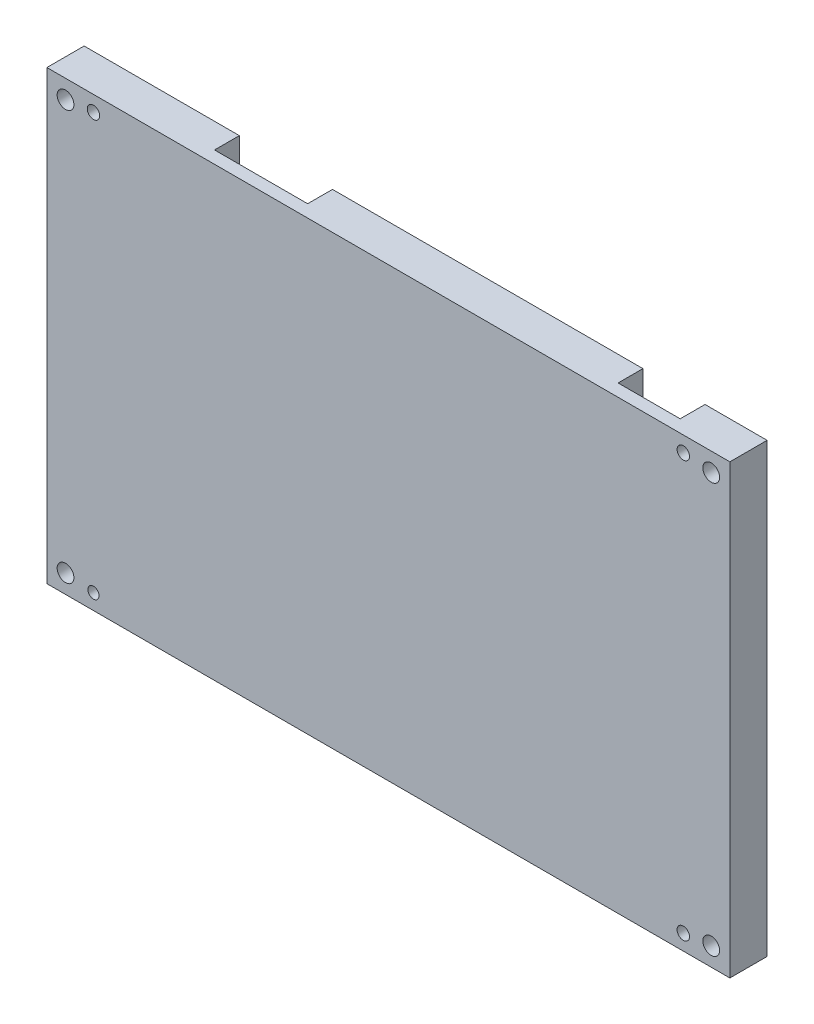
ISO-10303-21;
HEADER;
FILE_DESCRIPTION(('STEP AP214'),'2;1');
FILE_NAME('part.step','',(''),(''),'','','');
FILE_SCHEMA(('AUTOMOTIVE_DESIGN { 1 0 10303 214 1 1 1 1 }'));
ENDSEC;
DATA;
#1=APPLICATION_CONTEXT('core data for automotive mechanical design processes');
#2=APPLICATION_PROTOCOL_DEFINITION('international standard','automotive_design',2000,#1);
#3=PRODUCT_CONTEXT('',#1,'mechanical');
#4=PRODUCT('Part','Part','',(#3));
#5=PRODUCT_RELATED_PRODUCT_CATEGORY('part','',(#4));
#6=PRODUCT_DEFINITION_FORMATION('','',#4);
#7=PRODUCT_DEFINITION_CONTEXT('part definition',#1,'design');
#8=PRODUCT_DEFINITION('design','',#6,#7);
#9=PRODUCT_DEFINITION_SHAPE('','',#8);
#10=(LENGTH_UNIT() NAMED_UNIT(*) SI_UNIT(.MILLI.,.METRE.));
#11=(NAMED_UNIT(*) PLANE_ANGLE_UNIT() SI_UNIT($,.RADIAN.));
#12=(NAMED_UNIT(*) SI_UNIT($,.STERADIAN.) SOLID_ANGLE_UNIT());
#13=UNCERTAINTY_MEASURE_WITH_UNIT(LENGTH_MEASURE(1.E-05),#10,'distance_accuracy_value','');
#14=(GEOMETRIC_REPRESENTATION_CONTEXT(3) GLOBAL_UNCERTAINTY_ASSIGNED_CONTEXT((#13)) GLOBAL_UNIT_ASSIGNED_CONTEXT((#10,
#11,#12)) REPRESENTATION_CONTEXT('',''));
#15=CARTESIAN_POINT('',(0.,0.,0.));
#16=DIRECTION('',(0.,0.,1.));
#17=DIRECTION('',(1.,0.,0.));
#18=AXIS2_PLACEMENT_3D('',#15,#16,#17);
#19=CARTESIAN_POINT('',(0.,0.,0.));
#20=DIRECTION('',(0.,0.,-1.));
#21=DIRECTION('',(-1.,0.,0.));
#22=AXIS2_PLACEMENT_3D('',#19,#20,#21);
#23=PLANE('',#22);
#24=CARTESIAN_POINT('',(107.,3.,0.));
#25=DIRECTION('',(0.,0.,1.));
#26=DIRECTION('',(1.,0.,0.));
#27=AXIS2_PLACEMENT_3D('',#24,#25,#26);
#28=CIRCLE('',#27,1.35000000000001);
#29=CARTESIAN_POINT('',(108.35,3.,0.));
#30=VERTEX_POINT('',#29);
#31=EDGE_CURVE('E379',#30,#30,#28,.T.);
#32=ORIENTED_EDGE('',*,*,#31,.T.);
#33=EDGE_LOOP('',(#32));
#34=FACE_BOUND('',#33,.T.);
#35=CARTESIAN_POINT('',(3.,69.,0.));
#36=DIRECTION('',(0.,0.,1.));
#37=DIRECTION('',(1.,0.,0.));
#38=AXIS2_PLACEMENT_3D('',#35,#36,#37);
#39=CIRCLE('',#38,1.35);
#40=CARTESIAN_POINT('',(4.35,69.,0.));
#41=VERTEX_POINT('',#40);
#42=EDGE_CURVE('E391',#41,#41,#39,.T.);
#43=ORIENTED_EDGE('',*,*,#42,.T.);
#44=EDGE_LOOP('',(#43));
#45=FACE_BOUND('',#44,.T.);
#46=CARTESIAN_POINT('',(3.,3.,0.));
#47=DIRECTION('',(0.,0.,1.));
#48=DIRECTION('',(1.,0.,0.));
#49=AXIS2_PLACEMENT_3D('',#46,#47,#48);
#50=CIRCLE('',#49,1.35);
#51=CARTESIAN_POINT('',(4.35,3.,0.));
#52=VERTEX_POINT('',#51);
#53=EDGE_CURVE('E385',#52,#52,#50,.T.);
#54=ORIENTED_EDGE('',*,*,#53,.T.);
#55=EDGE_LOOP('',(#54));
#56=FACE_BOUND('',#55,.T.);
#57=CARTESIAN_POINT('',(107.,69.,0.));
#58=DIRECTION('',(0.,0.,1.));
#59=DIRECTION('',(1.,0.,0.));
#60=AXIS2_PLACEMENT_3D('',#57,#58,#59);
#61=CIRCLE('',#60,1.35000000000001);
#62=CARTESIAN_POINT('',(108.35,69.,0.));
#63=VERTEX_POINT('',#62);
#64=EDGE_CURVE('E245',#63,#63,#61,.T.);
#65=ORIENTED_EDGE('',*,*,#64,.T.);
#66=EDGE_LOOP('',(#65));
#67=FACE_BOUND('',#66,.T.);
#68=CARTESIAN_POINT('',(7.50000000000001,2.5,0.));
#69=DIRECTION('',(0.,0.,1.));
#70=DIRECTION('',(1.,0.,0.));
#71=AXIS2_PLACEMENT_3D('',#68,#69,#70);
#72=CIRCLE('',#71,0.9);
#73=CARTESIAN_POINT('',(8.40000000000001,2.5,0.));
#74=VERTEX_POINT('',#73);
#75=EDGE_CURVE('E287',#74,#74,#72,.T.);
#76=ORIENTED_EDGE('',*,*,#75,.T.);
#77=EDGE_LOOP('',(#76));
#78=FACE_BOUND('',#77,.T.);
#79=CARTESIAN_POINT('',(102.5,2.5,0.));
#80=DIRECTION('',(0.,0.,1.));
#81=DIRECTION('',(1.,0.,0.));
#82=AXIS2_PLACEMENT_3D('',#79,#80,#81);
#83=CIRCLE('',#82,0.999999999999998);
#84=CARTESIAN_POINT('',(103.5,2.5,0.));
#85=VERTEX_POINT('',#84);
#86=EDGE_CURVE('E294',#85,#85,#83,.T.);
#87=ORIENTED_EDGE('',*,*,#86,.T.);
#88=EDGE_LOOP('',(#87));
#89=FACE_BOUND('',#88,.T.);
#90=CARTESIAN_POINT('',(102.5,69.5,0.));
#91=DIRECTION('',(0.,0.,1.));
#92=DIRECTION('',(1.,0.,0.));
#93=AXIS2_PLACEMENT_3D('',#90,#91,#92);
#94=CIRCLE('',#93,0.999999999999998);
#95=CARTESIAN_POINT('',(103.5,69.5,0.));
#96=VERTEX_POINT('',#95);
#97=EDGE_CURVE('E300',#96,#96,#94,.T.);
#98=ORIENTED_EDGE('',*,*,#97,.T.);
#99=EDGE_LOOP('',(#98));
#100=FACE_BOUND('',#99,.T.);
#101=CARTESIAN_POINT('',(7.5,69.5,0.));
#102=DIRECTION('',(0.,0.,1.));
#103=DIRECTION('',(1.,0.,0.));
#104=AXIS2_PLACEMENT_3D('',#101,#102,#103);
#105=CIRCLE('',#104,1.);
#106=CARTESIAN_POINT('',(8.5,69.5,0.));
#107=VERTEX_POINT('',#106);
#108=EDGE_CURVE('E305',#107,#107,#105,.T.);
#109=ORIENTED_EDGE('',*,*,#108,.T.);
#110=EDGE_LOOP('',(#109));
#111=FACE_BOUND('',#110,.T.);
#112=DIRECTION('',(-1.,0.,0.));
#113=VECTOR('',#112,1.);
#114=CARTESIAN_POINT('',(5.,47.,0.));
#115=LINE('',#114,#113);
#116=CARTESIAN_POINT('',(82.,47.,0.));
#117=VERTEX_POINT('',#116);
#118=CARTESIAN_POINT('',(5.,47.,0.));
#119=VERTEX_POINT('',#118);
#120=EDGE_CURVE('E263',#117,#119,#115,.T.);
#121=ORIENTED_EDGE('',*,*,#120,.T.);
#122=DIRECTION('',(0.,-1.,0.));
#123=VECTOR('',#122,1.);
#124=CARTESIAN_POINT('',(5.,47.,0.));
#125=LINE('',#124,#123);
#126=CARTESIAN_POINT('',(5.00000000000001,7.,0.));
#127=VERTEX_POINT('',#126);
#128=EDGE_CURVE('E192',#119,#127,#125,.T.);
#129=ORIENTED_EDGE('',*,*,#128,.T.);
#130=DIRECTION('',(1.,0.,0.));
#131=VECTOR('',#130,1.);
#132=CARTESIAN_POINT('',(5.00000000000001,7.,0.));
#133=LINE('',#132,#131);
#134=CARTESIAN_POINT('',(82.,7.,0.));
#135=VERTEX_POINT('',#134);
#136=EDGE_CURVE('E196',#127,#135,#133,.T.);
#137=ORIENTED_EDGE('',*,*,#136,.T.);
#138=DIRECTION('',(0.,1.,0.));
#139=VECTOR('',#138,1.);
#140=CARTESIAN_POINT('',(82.,47.,0.));
#141=LINE('',#140,#139);
#142=EDGE_CURVE('E272',#135,#117,#141,.T.);
#143=ORIENTED_EDGE('',*,*,#142,.T.);
#144=EDGE_LOOP('',(#121,#129,#137,#143));
#145=FACE_BOUND('',#144,.T.);
#146=DIRECTION('',(-1.,0.,0.));
#147=VECTOR('',#146,1.);
#148=CARTESIAN_POINT('',(94.,39.,0.));
#149=LINE('',#148,#147);
#150=CARTESIAN_POINT('',(102.,39.,0.));
#151=VERTEX_POINT('',#150);
#152=CARTESIAN_POINT('',(94.,39.,0.));
#153=VERTEX_POINT('',#152);
#154=EDGE_CURVE('E236',#151,#153,#149,.T.);
#155=ORIENTED_EDGE('',*,*,#154,.T.);
#156=DIRECTION('',(0.,-1.,0.));
#157=VECTOR('',#156,1.);
#158=CARTESIAN_POINT('',(94.,23.,0.));
#159=LINE('',#158,#157);
#160=CARTESIAN_POINT('',(94.,23.,0.));
#161=VERTEX_POINT('',#160);
#162=EDGE_CURVE('E49',#153,#161,#159,.T.);
#163=ORIENTED_EDGE('',*,*,#162,.T.);
#164=DIRECTION('',(1.,0.,0.));
#165=VECTOR('',#164,1.);
#166=CARTESIAN_POINT('',(94.,23.,0.));
#167=LINE('',#166,#165);
#168=CARTESIAN_POINT('',(102.,23.,0.));
#169=VERTEX_POINT('',#168);
#170=EDGE_CURVE('E244',#161,#169,#167,.T.);
#171=ORIENTED_EDGE('',*,*,#170,.T.);
#172=DIRECTION('',(0.,1.,0.));
#173=VECTOR('',#172,1.);
#174=CARTESIAN_POINT('',(102.,23.,0.));
#175=LINE('',#174,#173);
#176=EDGE_CURVE('E248',#169,#151,#175,.T.);
#177=ORIENTED_EDGE('',*,*,#176,.T.);
#178=EDGE_LOOP('',(#155,#163,#171,#177));
#179=FACE_BOUND('',#178,.T.);
#180=DIRECTION('',(-1.,0.,0.));
#181=VECTOR('',#180,1.);
#182=CARTESIAN_POINT('',(0.,72.,0.));
#183=LINE('',#182,#181);
#184=CARTESIAN_POINT('',(25.,72.,0.));
#185=VERTEX_POINT('',#184);
#186=CARTESIAN_POINT('',(0.,72.,0.));
#187=VERTEX_POINT('',#186);
#188=EDGE_CURVE('E328',#185,#187,#183,.T.);
#189=ORIENTED_EDGE('',*,*,#188,.F.);
#190=DIRECTION('',(0.,-1.,0.));
#191=VECTOR('',#190,1.);
#192=CARTESIAN_POINT('',(25.,72.,0.));
#193=LINE('',#192,#191);
#194=CARTESIAN_POINT('',(25.,64.,0.));
#195=VERTEX_POINT('',#194);
#196=EDGE_CURVE('E231',#185,#195,#193,.T.);
#197=ORIENTED_EDGE('',*,*,#196,.T.);
#198=DIRECTION('',(1.,0.,0.));
#199=VECTOR('',#198,1.);
#200=CARTESIAN_POINT('',(25.,64.,0.));
#201=LINE('',#200,#199);
#202=CARTESIAN_POINT('',(40.,64.,0.));
#203=VERTEX_POINT('',#202);
#204=EDGE_CURVE('E191',#195,#203,#201,.T.);
#205=ORIENTED_EDGE('',*,*,#204,.T.);
#206=DIRECTION('',(0.,1.,0.));
#207=VECTOR('',#206,1.);
#208=CARTESIAN_POINT('',(40.,72.,0.));
#209=LINE('',#208,#207);
#210=CARTESIAN_POINT('',(40.,72.,0.));
#211=VERTEX_POINT('',#210);
#212=EDGE_CURVE('E187',#203,#211,#209,.T.);
#213=ORIENTED_EDGE('',*,*,#212,.T.);
#214=CARTESIAN_POINT('',(90.,72.,0.));
#215=VERTEX_POINT('',#214);
#216=EDGE_CURVE('E331',#215,#211,#183,.T.);
#217=ORIENTED_EDGE('',*,*,#216,.F.);
#218=DIRECTION('',(0.,-1.,0.));
#219=VECTOR('',#218,1.);
#220=CARTESIAN_POINT('',(90.,72.,0.));
#221=LINE('',#220,#219);
#222=CARTESIAN_POINT('',(90.,64.,0.));
#223=VERTEX_POINT('',#222);
#224=EDGE_CURVE('E217',#215,#223,#221,.T.);
#225=ORIENTED_EDGE('',*,*,#224,.T.);
#226=DIRECTION('',(1.,0.,0.));
#227=VECTOR('',#226,1.);
#228=CARTESIAN_POINT('',(100.,64.,0.));
#229=LINE('',#228,#227);
#230=CARTESIAN_POINT('',(100.,64.,0.));
#231=VERTEX_POINT('',#230);
#232=EDGE_CURVE('E206',#223,#231,#229,.T.);
#233=ORIENTED_EDGE('',*,*,#232,.T.);
#234=DIRECTION('',(0.,1.,0.));
#235=VECTOR('',#234,1.);
#236=CARTESIAN_POINT('',(100.,72.,0.));
#237=LINE('',#236,#235);
#238=CARTESIAN_POINT('',(100.,72.,0.));
#239=VERTEX_POINT('',#238);
#240=EDGE_CURVE('E214',#231,#239,#237,.T.);
#241=ORIENTED_EDGE('',*,*,#240,.T.);
#242=CARTESIAN_POINT('',(110.,72.,0.));
#243=VERTEX_POINT('',#242);
#244=EDGE_CURVE('E315',#243,#239,#183,.T.);
#245=ORIENTED_EDGE('',*,*,#244,.F.);
#246=DIRECTION('',(0.,1.,0.));
#247=VECTOR('',#246,1.);
#248=CARTESIAN_POINT('',(110.,0.,0.));
#249=LINE('',#248,#247);
#250=CARTESIAN_POINT('',(110.,0.,0.));
#251=VERTEX_POINT('',#250);
#252=EDGE_CURVE('E326',#251,#243,#249,.T.);
#253=ORIENTED_EDGE('',*,*,#252,.F.);
#254=DIRECTION('',(1.,0.,0.));
#255=VECTOR('',#254,1.);
#256=CARTESIAN_POINT('',(0.,0.,0.));
#257=LINE('',#256,#255);
#258=CARTESIAN_POINT('',(0.,0.,0.));
#259=VERTEX_POINT('',#258);
#260=EDGE_CURVE('E324',#259,#251,#257,.T.);
#261=ORIENTED_EDGE('',*,*,#260,.F.);
#262=DIRECTION('',(0.,-1.,0.));
#263=VECTOR('',#262,1.);
#264=CARTESIAN_POINT('',(0.,0.,0.));
#265=LINE('',#264,#263);
#266=EDGE_CURVE('E308',#187,#259,#265,.T.);
#267=ORIENTED_EDGE('',*,*,#266,.F.);
#268=EDGE_LOOP('',(#189,#197,#205,#213,#217,#225,#233,#241,#245,#253,#261,#267));
#269=FACE_BOUND('',#268,.T.);
#270=ADVANCED_FACE('F34',(#34,#45,#56,#67,#78,#89,#100,#111,#145,#179,#269),#23,.T.);
#271=CARTESIAN_POINT('',(0.,72.,6.));
#272=DIRECTION('',(0.,-1.,0.));
#273=DIRECTION('',(0.,0.,-1.));
#274=AXIS2_PLACEMENT_3D('',#271,#272,#273);
#275=PLANE('',#274);
#276=DIRECTION('',(0.,0.,-1.));
#277=VECTOR('',#276,1.);
#278=CARTESIAN_POINT('',(25.,72.,4.));
#279=LINE('',#278,#277);
#280=CARTESIAN_POINT('',(25.,72.,4.));
#281=VERTEX_POINT('',#280);
#282=EDGE_CURVE('E185',#281,#185,#279,.T.);
#283=ORIENTED_EDGE('',*,*,#282,.T.);
#284=ORIENTED_EDGE('',*,*,#188,.T.);
#285=DIRECTION('',(0.,0.,-1.));
#286=VECTOR('',#285,1.);
#287=CARTESIAN_POINT('',(0.,72.,6.));
#288=LINE('',#287,#286);
#289=CARTESIAN_POINT('',(0.,72.,6.));
#290=VERTEX_POINT('',#289);
#291=EDGE_CURVE('E321',#290,#187,#288,.T.);
#292=ORIENTED_EDGE('',*,*,#291,.F.);
#293=DIRECTION('',(-1.,0.,0.));
#294=VECTOR('',#293,1.);
#295=CARTESIAN_POINT('',(0.,72.,6.));
#296=LINE('',#295,#294);
#297=CARTESIAN_POINT('',(110.,72.,6.));
#298=VERTEX_POINT('',#297);
#299=EDGE_CURVE('E319',#298,#290,#296,.T.);
#300=ORIENTED_EDGE('',*,*,#299,.F.);
#301=DIRECTION('',(0.,0.,-1.));
#302=VECTOR('',#301,1.);
#303=CARTESIAN_POINT('',(110.,72.,6.));
#304=LINE('',#303,#302);
#305=EDGE_CURVE('E334',#298,#243,#304,.T.);
#306=ORIENTED_EDGE('',*,*,#305,.T.);
#307=ORIENTED_EDGE('',*,*,#244,.T.);
#308=DIRECTION('',(0.,0.,-1.));
#309=VECTOR('',#308,1.);
#310=CARTESIAN_POINT('',(100.,72.,4.));
#311=LINE('',#310,#309);
#312=CARTESIAN_POINT('',(100.,72.,4.));
#313=VERTEX_POINT('',#312);
#314=EDGE_CURVE('E229',#313,#239,#311,.T.);
#315=ORIENTED_EDGE('',*,*,#314,.F.);
#316=DIRECTION('',(-1.,0.,0.));
#317=VECTOR('',#316,1.);
#318=CARTESIAN_POINT('',(100.,72.,4.));
#319=LINE('',#318,#317);
#320=CARTESIAN_POINT('',(90.,72.,4.));
#321=VERTEX_POINT('',#320);
#322=EDGE_CURVE('E205',#313,#321,#319,.T.);
#323=ORIENTED_EDGE('',*,*,#322,.T.);
#324=DIRECTION('',(0.,0.,-1.));
#325=VECTOR('',#324,1.);
#326=CARTESIAN_POINT('',(90.,72.,4.));
#327=LINE('',#326,#325);
#328=EDGE_CURVE('E226',#321,#215,#327,.T.);
#329=ORIENTED_EDGE('',*,*,#328,.T.);
#330=ORIENTED_EDGE('',*,*,#216,.T.);
#331=DIRECTION('',(0.,0.,-1.));
#332=VECTOR('',#331,1.);
#333=CARTESIAN_POINT('',(40.,72.,4.));
#334=LINE('',#333,#332);
#335=CARTESIAN_POINT('',(40.,72.,4.));
#336=VERTEX_POINT('',#335);
#337=EDGE_CURVE('E198',#336,#211,#334,.T.);
#338=ORIENTED_EDGE('',*,*,#337,.F.);
#339=DIRECTION('',(-1.,0.,0.));
#340=VECTOR('',#339,1.);
#341=CARTESIAN_POINT('',(25.,72.,4.));
#342=LINE('',#341,#340);
#343=EDGE_CURVE('E371',#336,#281,#342,.T.);
#344=ORIENTED_EDGE('',*,*,#343,.T.);
#345=EDGE_LOOP('',(#283,#284,#292,#300,#306,#307,#315,#323,#329,#330,#338,#344));
#346=FACE_BOUND('',#345,.T.);
#347=ADVANCED_FACE('F351',(#346),#275,.F.);
#348=CARTESIAN_POINT('',(0.,0.,6.));
#349=DIRECTION('',(1.,0.,0.));
#350=DIRECTION('',(0.,0.,-1.));
#351=AXIS2_PLACEMENT_3D('',#348,#349,#350);
#352=PLANE('',#351);
#353=ORIENTED_EDGE('',*,*,#266,.T.);
#354=DIRECTION('',(0.,0.,-1.));
#355=VECTOR('',#354,1.);
#356=CARTESIAN_POINT('',(0.,0.,6.));
#357=LINE('',#356,#355);
#358=CARTESIAN_POINT('',(0.,0.,6.));
#359=VERTEX_POINT('',#358);
#360=EDGE_CURVE('E11',#359,#259,#357,.T.);
#361=ORIENTED_EDGE('',*,*,#360,.F.);
#362=DIRECTION('',(0.,-1.,0.));
#363=VECTOR('',#362,1.);
#364=CARTESIAN_POINT('',(0.,0.,6.));
#365=LINE('',#364,#363);
#366=EDGE_CURVE('E311',#290,#359,#365,.T.);
#367=ORIENTED_EDGE('',*,*,#366,.F.);
#368=ORIENTED_EDGE('',*,*,#291,.T.);
#369=EDGE_LOOP('',(#353,#361,#367,#368));
#370=FACE_BOUND('',#369,.T.);
#371=ADVANCED_FACE('F36',(#370),#352,.F.);
#372=CARTESIAN_POINT('',(0.,0.,6.));
#373=DIRECTION('',(0.,1.,0.));
#374=DIRECTION('',(0.,0.,1.));
#375=AXIS2_PLACEMENT_3D('',#372,#373,#374);
#376=PLANE('',#375);
#377=ORIENTED_EDGE('',*,*,#260,.T.);
#378=DIRECTION('',(0.,0.,-1.));
#379=VECTOR('',#378,1.);
#380=CARTESIAN_POINT('',(110.,0.,6.));
#381=LINE('',#380,#379);
#382=CARTESIAN_POINT('',(110.,0.,6.));
#383=VERTEX_POINT('',#382);
#384=EDGE_CURVE('E42',#383,#251,#381,.T.);
#385=ORIENTED_EDGE('',*,*,#384,.F.);
#386=DIRECTION('',(1.,0.,0.));
#387=VECTOR('',#386,1.);
#388=CARTESIAN_POINT('',(0.,0.,6.));
#389=LINE('',#388,#387);
#390=EDGE_CURVE('E314',#359,#383,#389,.T.);
#391=ORIENTED_EDGE('',*,*,#390,.F.);
#392=ORIENTED_EDGE('',*,*,#360,.T.);
#393=EDGE_LOOP('',(#377,#385,#391,#392));
#394=FACE_BOUND('',#393,.T.);
#395=ADVANCED_FACE('F358',(#394),#376,.F.);
#396=CARTESIAN_POINT('',(110.,0.,6.));
#397=DIRECTION('',(-1.,0.,0.));
#398=DIRECTION('',(0.,0.,1.));
#399=AXIS2_PLACEMENT_3D('',#396,#397,#398);
#400=PLANE('',#399);
#401=ORIENTED_EDGE('',*,*,#252,.T.);
#402=ORIENTED_EDGE('',*,*,#305,.F.);
#403=DIRECTION('',(0.,1.,0.));
#404=VECTOR('',#403,1.);
#405=CARTESIAN_POINT('',(110.,0.,6.));
#406=LINE('',#405,#404);
#407=EDGE_CURVE('E317',#383,#298,#406,.T.);
#408=ORIENTED_EDGE('',*,*,#407,.F.);
#409=ORIENTED_EDGE('',*,*,#384,.T.);
#410=EDGE_LOOP('',(#401,#402,#408,#409));
#411=FACE_BOUND('',#410,.T.);
#412=ADVANCED_FACE('F341',(#411),#400,.F.);
#413=CARTESIAN_POINT('',(0.,0.,6.));
#414=DIRECTION('',(0.,0.,-1.));
#415=DIRECTION('',(-1.,0.,0.));
#416=AXIS2_PLACEMENT_3D('',#413,#414,#415);
#417=PLANE('',#416);
#418=CARTESIAN_POINT('',(107.,3.,6.));
#419=DIRECTION('',(0.,0.,1.));
#420=DIRECTION('',(1.,0.,0.));
#421=AXIS2_PLACEMENT_3D('',#418,#419,#420);
#422=CIRCLE('',#421,1.35000000000001);
#423=CARTESIAN_POINT('',(108.35,3.,6.));
#424=VERTEX_POINT('',#423);
#425=EDGE_CURVE('E394',#424,#424,#422,.T.);
#426=ORIENTED_EDGE('',*,*,#425,.F.);
#427=EDGE_LOOP('',(#426));
#428=FACE_BOUND('',#427,.T.);
#429=CARTESIAN_POINT('',(3.,69.,6.));
#430=DIRECTION('',(0.,0.,1.));
#431=DIRECTION('',(1.,0.,0.));
#432=AXIS2_PLACEMENT_3D('',#429,#430,#431);
#433=CIRCLE('',#432,1.35);
#434=CARTESIAN_POINT('',(4.35,69.,6.));
#435=VERTEX_POINT('',#434);
#436=EDGE_CURVE('E388',#435,#435,#433,.T.);
#437=ORIENTED_EDGE('',*,*,#436,.F.);
#438=EDGE_LOOP('',(#437));
#439=FACE_BOUND('',#438,.T.);
#440=CARTESIAN_POINT('',(3.,3.,6.));
#441=DIRECTION('',(0.,0.,1.));
#442=DIRECTION('',(1.,0.,0.));
#443=AXIS2_PLACEMENT_3D('',#440,#441,#442);
#444=CIRCLE('',#443,1.35);
#445=CARTESIAN_POINT('',(4.35,3.,6.));
#446=VERTEX_POINT('',#445);
#447=EDGE_CURVE('E382',#446,#446,#444,.T.);
#448=ORIENTED_EDGE('',*,*,#447,.F.);
#449=EDGE_LOOP('',(#448));
#450=FACE_BOUND('',#449,.T.);
#451=CARTESIAN_POINT('',(107.,69.,6.));
#452=DIRECTION('',(0.,0.,1.));
#453=DIRECTION('',(1.,0.,0.));
#454=AXIS2_PLACEMENT_3D('',#451,#452,#453);
#455=CIRCLE('',#454,1.35000000000001);
#456=CARTESIAN_POINT('',(108.35,69.,6.));
#457=VERTEX_POINT('',#456);
#458=EDGE_CURVE('E376',#457,#457,#455,.T.);
#459=ORIENTED_EDGE('',*,*,#458,.F.);
#460=EDGE_LOOP('',(#459));
#461=FACE_BOUND('',#460,.T.);
#462=CARTESIAN_POINT('',(7.50000000000001,2.5,6.));
#463=DIRECTION('',(0.,0.,1.));
#464=DIRECTION('',(1.,0.,0.));
#465=AXIS2_PLACEMENT_3D('',#462,#463,#464);
#466=CIRCLE('',#465,0.9);
#467=CARTESIAN_POINT('',(8.40000000000001,2.5,6.));
#468=VERTEX_POINT('',#467);
#469=EDGE_CURVE('E291',#468,#468,#466,.T.);
#470=ORIENTED_EDGE('',*,*,#469,.F.);
#471=EDGE_LOOP('',(#470));
#472=FACE_BOUND('',#471,.T.);
#473=CARTESIAN_POINT('',(102.5,2.5,6.));
#474=DIRECTION('',(0.,0.,1.));
#475=DIRECTION('',(1.,0.,0.));
#476=AXIS2_PLACEMENT_3D('',#473,#474,#475);
#477=CIRCLE('',#476,0.999999999999998);
#478=CARTESIAN_POINT('',(103.5,2.5,6.));
#479=VERTEX_POINT('',#478);
#480=EDGE_CURVE('E297',#479,#479,#477,.T.);
#481=ORIENTED_EDGE('',*,*,#480,.F.);
#482=EDGE_LOOP('',(#481));
#483=FACE_BOUND('',#482,.T.);
#484=CARTESIAN_POINT('',(102.5,69.5,6.));
#485=DIRECTION('',(0.,0.,1.));
#486=DIRECTION('',(1.,0.,0.));
#487=AXIS2_PLACEMENT_3D('',#484,#485,#486);
#488=CIRCLE('',#487,0.999999999999998);
#489=CARTESIAN_POINT('',(103.5,69.5,6.));
#490=VERTEX_POINT('',#489);
#491=EDGE_CURVE('E286',#490,#490,#488,.T.);
#492=ORIENTED_EDGE('',*,*,#491,.F.);
#493=EDGE_LOOP('',(#492));
#494=FACE_BOUND('',#493,.T.);
#495=CARTESIAN_POINT('',(7.5,69.5,6.));
#496=DIRECTION('',(0.,0.,1.));
#497=DIRECTION('',(1.,0.,0.));
#498=AXIS2_PLACEMENT_3D('',#495,#496,#497);
#499=CIRCLE('',#498,1.);
#500=CARTESIAN_POINT('',(8.5,69.5,6.));
#501=VERTEX_POINT('',#500);
#502=EDGE_CURVE('E290',#501,#501,#499,.T.);
#503=ORIENTED_EDGE('',*,*,#502,.F.);
#504=EDGE_LOOP('',(#503));
#505=FACE_BOUND('',#504,.T.);
#506=ORIENTED_EDGE('',*,*,#366,.T.);
#507=ORIENTED_EDGE('',*,*,#390,.T.);
#508=ORIENTED_EDGE('',*,*,#407,.T.);
#509=ORIENTED_EDGE('',*,*,#299,.T.);
#510=EDGE_LOOP('',(#506,#507,#508,#509));
#511=FACE_BOUND('',#510,.T.);
#512=ADVANCED_FACE('F356',(#428,#439,#450,#461,#472,#483,#494,#505,#511),#417,.F.);
#513=CARTESIAN_POINT('',(7.5,69.5,0.));
#514=DIRECTION('',(0.,0.,1.));
#515=DIRECTION('',(1.,0.,0.));
#516=AXIS2_PLACEMENT_3D('',#513,#514,#515);
#517=CYLINDRICAL_SURFACE('',#516,1.);
#518=ORIENTED_EDGE('',*,*,#108,.F.);
#519=EDGE_LOOP('',(#518));
#520=FACE_BOUND('',#519,.T.);
#521=ORIENTED_EDGE('',*,*,#502,.T.);
#522=EDGE_LOOP('',(#521));
#523=FACE_BOUND('',#522,.T.);
#524=ADVANCED_FACE('F411',(#520,#523),#517,.F.);
#525=CARTESIAN_POINT('',(102.5,69.5,0.));
#526=DIRECTION('',(0.,0.,1.));
#527=DIRECTION('',(1.,0.,0.));
#528=AXIS2_PLACEMENT_3D('',#525,#526,#527);
#529=CYLINDRICAL_SURFACE('',#528,0.999999999999998);
#530=ORIENTED_EDGE('',*,*,#97,.F.);
#531=EDGE_LOOP('',(#530));
#532=FACE_BOUND('',#531,.T.);
#533=ORIENTED_EDGE('',*,*,#491,.T.);
#534=EDGE_LOOP('',(#533));
#535=FACE_BOUND('',#534,.T.);
#536=ADVANCED_FACE('F428',(#532,#535),#529,.F.);
#537=CARTESIAN_POINT('',(102.5,2.5,0.));
#538=DIRECTION('',(0.,0.,1.));
#539=DIRECTION('',(1.,0.,0.));
#540=AXIS2_PLACEMENT_3D('',#537,#538,#539);
#541=CYLINDRICAL_SURFACE('',#540,0.999999999999998);
#542=ORIENTED_EDGE('',*,*,#86,.F.);
#543=EDGE_LOOP('',(#542));
#544=FACE_BOUND('',#543,.T.);
#545=ORIENTED_EDGE('',*,*,#480,.T.);
#546=EDGE_LOOP('',(#545));
#547=FACE_BOUND('',#546,.T.);
#548=ADVANCED_FACE('F434',(#544,#547),#541,.F.);
#549=CARTESIAN_POINT('',(7.50000000000001,2.5,0.));
#550=DIRECTION('',(0.,0.,1.));
#551=DIRECTION('',(1.,0.,0.));
#552=AXIS2_PLACEMENT_3D('',#549,#550,#551);
#553=CYLINDRICAL_SURFACE('',#552,0.9);
#554=ORIENTED_EDGE('',*,*,#75,.F.);
#555=EDGE_LOOP('',(#554));
#556=FACE_BOUND('',#555,.T.);
#557=ORIENTED_EDGE('',*,*,#469,.T.);
#558=EDGE_LOOP('',(#557));
#559=FACE_BOUND('',#558,.T.);
#560=ADVANCED_FACE('F464',(#556,#559),#553,.F.);
#561=CARTESIAN_POINT('',(5.,47.,4.));
#562=DIRECTION('',(1.,0.,0.));
#563=DIRECTION('',(0.,1.,0.));
#564=AXIS2_PLACEMENT_3D('',#561,#562,#563);
#565=PLANE('',#564);
#566=ORIENTED_EDGE('',*,*,#128,.F.);
#567=DIRECTION('',(0.,0.,-1.));
#568=VECTOR('',#567,1.);
#569=CARTESIAN_POINT('',(5.,47.,4.));
#570=LINE('',#569,#568);
#571=CARTESIAN_POINT('',(5.,47.,4.));
#572=VERTEX_POINT('',#571);
#573=EDGE_CURVE('E268',#572,#119,#570,.T.);
#574=ORIENTED_EDGE('',*,*,#573,.F.);
#575=DIRECTION('',(0.,-1.,0.));
#576=VECTOR('',#575,1.);
#577=CARTESIAN_POINT('',(5.,47.,4.));
#578=LINE('',#577,#576);
#579=CARTESIAN_POINT('',(5.00000000000001,7.,4.));
#580=VERTEX_POINT('',#579);
#581=EDGE_CURVE('E259',#572,#580,#578,.T.);
#582=ORIENTED_EDGE('',*,*,#581,.T.);
#583=DIRECTION('',(0.,0.,-1.));
#584=VECTOR('',#583,1.);
#585=CARTESIAN_POINT('',(5.00000000000001,7.,4.));
#586=LINE('',#585,#584);
#587=EDGE_CURVE('E283',#580,#127,#586,.T.);
#588=ORIENTED_EDGE('',*,*,#587,.T.);
#589=EDGE_LOOP('',(#566,#574,#582,#588));
#590=FACE_BOUND('',#589,.T.);
#591=ADVANCED_FACE('F468',(#590),#565,.T.);
#592=CARTESIAN_POINT('',(5.00000000000001,7.,4.));
#593=DIRECTION('',(0.,1.,0.));
#594=DIRECTION('',(0.,0.,1.));
#595=AXIS2_PLACEMENT_3D('',#592,#593,#594);
#596=PLANE('',#595);
#597=ORIENTED_EDGE('',*,*,#136,.F.);
#598=ORIENTED_EDGE('',*,*,#587,.F.);
#599=DIRECTION('',(1.,0.,0.));
#600=VECTOR('',#599,1.);
#601=CARTESIAN_POINT('',(5.00000000000001,7.,4.));
#602=LINE('',#601,#600);
#603=CARTESIAN_POINT('',(82.,7.,4.));
#604=VERTEX_POINT('',#603);
#605=EDGE_CURVE('E262',#580,#604,#602,.T.);
#606=ORIENTED_EDGE('',*,*,#605,.T.);
#607=DIRECTION('',(0.,0.,-1.));
#608=VECTOR('',#607,1.);
#609=CARTESIAN_POINT('',(82.,7.,4.));
#610=LINE('',#609,#608);
#611=EDGE_CURVE('E281',#604,#135,#610,.T.);
#612=ORIENTED_EDGE('',*,*,#611,.T.);
#613=EDGE_LOOP('',(#597,#598,#606,#612));
#614=FACE_BOUND('',#613,.T.);
#615=ADVANCED_FACE('F473',(#614),#596,.T.);
#616=CARTESIAN_POINT('',(82.,47.,4.));
#617=DIRECTION('',(-1.,0.,0.));
#618=DIRECTION('',(0.,-1.,0.));
#619=AXIS2_PLACEMENT_3D('',#616,#617,#618);
#620=PLANE('',#619);
#621=ORIENTED_EDGE('',*,*,#142,.F.);
#622=ORIENTED_EDGE('',*,*,#611,.F.);
#623=DIRECTION('',(0.,1.,0.));
#624=VECTOR('',#623,1.);
#625=CARTESIAN_POINT('',(82.,47.,4.));
#626=LINE('',#625,#624);
#627=CARTESIAN_POINT('',(82.,47.,4.));
#628=VERTEX_POINT('',#627);
#629=EDGE_CURVE('E265',#604,#628,#626,.T.);
#630=ORIENTED_EDGE('',*,*,#629,.T.);
#631=DIRECTION('',(0.,0.,-1.));
#632=VECTOR('',#631,1.);
#633=CARTESIAN_POINT('',(82.,47.,4.));
#634=LINE('',#633,#632);
#635=EDGE_CURVE('E279',#628,#117,#634,.T.);
#636=ORIENTED_EDGE('',*,*,#635,.T.);
#637=EDGE_LOOP('',(#621,#622,#630,#636));
#638=FACE_BOUND('',#637,.T.);
#639=ADVANCED_FACE('F483',(#638),#620,.T.);
#640=CARTESIAN_POINT('',(5.,47.,4.));
#641=DIRECTION('',(0.,-1.,0.));
#642=DIRECTION('',(0.,0.,-1.));
#643=AXIS2_PLACEMENT_3D('',#640,#641,#642);
#644=PLANE('',#643);
#645=ORIENTED_EDGE('',*,*,#120,.F.);
#646=ORIENTED_EDGE('',*,*,#635,.F.);
#647=DIRECTION('',(-1.,0.,0.));
#648=VECTOR('',#647,1.);
#649=CARTESIAN_POINT('',(5.,47.,4.));
#650=LINE('',#649,#648);
#651=EDGE_CURVE('E267',#628,#572,#650,.T.);
#652=ORIENTED_EDGE('',*,*,#651,.T.);
#653=ORIENTED_EDGE('',*,*,#573,.T.);
#654=EDGE_LOOP('',(#645,#646,#652,#653));
#655=FACE_BOUND('',#654,.T.);
#656=ADVANCED_FACE('F493',(#655),#644,.T.);
#657=CARTESIAN_POINT('',(0.,0.,4.));
#658=DIRECTION('',(0.,0.,1.));
#659=DIRECTION('',(1.,0.,0.));
#660=AXIS2_PLACEMENT_3D('',#657,#658,#659);
#661=PLANE('',#660);
#662=ORIENTED_EDGE('',*,*,#581,.F.);
#663=ORIENTED_EDGE('',*,*,#651,.F.);
#664=ORIENTED_EDGE('',*,*,#629,.F.);
#665=ORIENTED_EDGE('',*,*,#605,.F.);
#666=EDGE_LOOP('',(#662,#663,#664,#665));
#667=FACE_BOUND('',#666,.T.);
#668=ADVANCED_FACE('F503',(#667),#661,.F.);
#669=CARTESIAN_POINT('',(100.,72.,4.));
#670=DIRECTION('',(-1.,0.,0.));
#671=DIRECTION('',(0.,0.,1.));
#672=AXIS2_PLACEMENT_3D('',#669,#670,#671);
#673=PLANE('',#672);
#674=ORIENTED_EDGE('',*,*,#240,.F.);
#675=DIRECTION('',(0.,0.,-1.));
#676=VECTOR('',#675,1.);
#677=CARTESIAN_POINT('',(100.,64.,4.));
#678=LINE('',#677,#676);
#679=CARTESIAN_POINT('',(100.,64.,4.));
#680=VERTEX_POINT('',#679);
#681=EDGE_CURVE('E213',#680,#231,#678,.T.);
#682=ORIENTED_EDGE('',*,*,#681,.F.);
#683=DIRECTION('',(0.,1.,0.));
#684=VECTOR('',#683,1.);
#685=CARTESIAN_POINT('',(100.,72.,4.));
#686=LINE('',#685,#684);
#687=EDGE_CURVE('E202',#680,#313,#686,.T.);
#688=ORIENTED_EDGE('',*,*,#687,.T.);
#689=ORIENTED_EDGE('',*,*,#314,.T.);
#690=EDGE_LOOP('',(#674,#682,#688,#689));
#691=FACE_BOUND('',#690,.T.);
#692=ADVANCED_FACE('F513',(#691),#673,.T.);
#693=CARTESIAN_POINT('',(90.,72.,4.));
#694=DIRECTION('',(1.,0.,0.));
#695=DIRECTION('',(0.,0.,-1.));
#696=AXIS2_PLACEMENT_3D('',#693,#694,#695);
#697=PLANE('',#696);
#698=ORIENTED_EDGE('',*,*,#224,.F.);
#699=ORIENTED_EDGE('',*,*,#328,.F.);
#700=DIRECTION('',(0.,-1.,0.));
#701=VECTOR('',#700,1.);
#702=CARTESIAN_POINT('',(90.,72.,4.));
#703=LINE('',#702,#701);
#704=CARTESIAN_POINT('',(90.,64.,4.));
#705=VERTEX_POINT('',#704);
#706=EDGE_CURVE('E209',#321,#705,#703,.T.);
#707=ORIENTED_EDGE('',*,*,#706,.T.);
#708=DIRECTION('',(0.,0.,-1.));
#709=VECTOR('',#708,1.);
#710=CARTESIAN_POINT('',(90.,64.,4.));
#711=LINE('',#710,#709);
#712=EDGE_CURVE('E224',#705,#223,#711,.T.);
#713=ORIENTED_EDGE('',*,*,#712,.T.);
#714=EDGE_LOOP('',(#698,#699,#707,#713));
#715=FACE_BOUND('',#714,.T.);
#716=ADVANCED_FACE('F523',(#715),#697,.T.);
#717=CARTESIAN_POINT('',(100.,64.,4.));
#718=DIRECTION('',(0.,1.,0.));
#719=DIRECTION('',(0.,0.,1.));
#720=AXIS2_PLACEMENT_3D('',#717,#718,#719);
#721=PLANE('',#720);
#722=ORIENTED_EDGE('',*,*,#232,.F.);
#723=ORIENTED_EDGE('',*,*,#712,.F.);
#724=DIRECTION('',(1.,0.,0.));
#725=VECTOR('',#724,1.);
#726=CARTESIAN_POINT('',(100.,64.,4.));
#727=LINE('',#726,#725);
#728=EDGE_CURVE('E211',#705,#680,#727,.T.);
#729=ORIENTED_EDGE('',*,*,#728,.T.);
#730=ORIENTED_EDGE('',*,*,#681,.T.);
#731=EDGE_LOOP('',(#722,#723,#729,#730));
#732=FACE_BOUND('',#731,.T.);
#733=ADVANCED_FACE('F533',(#732),#721,.T.);
#734=CARTESIAN_POINT('',(0.,0.,4.));
#735=DIRECTION('',(0.,0.,-1.));
#736=DIRECTION('',(-1.,0.,0.));
#737=AXIS2_PLACEMENT_3D('',#734,#735,#736);
#738=PLANE('',#737);
#739=ORIENTED_EDGE('',*,*,#687,.F.);
#740=ORIENTED_EDGE('',*,*,#728,.F.);
#741=ORIENTED_EDGE('',*,*,#706,.F.);
#742=ORIENTED_EDGE('',*,*,#322,.F.);
#743=EDGE_LOOP('',(#739,#740,#741,#742));
#744=FACE_BOUND('',#743,.T.);
#745=ADVANCED_FACE('F543',(#744),#738,.T.);
#746=CARTESIAN_POINT('',(25.,72.,4.));
#747=DIRECTION('',(1.,0.,0.));
#748=DIRECTION('',(0.,1.,0.));
#749=AXIS2_PLACEMENT_3D('',#746,#747,#748);
#750=PLANE('',#749);
#751=ORIENTED_EDGE('',*,*,#196,.F.);
#752=ORIENTED_EDGE('',*,*,#282,.F.);
#753=DIRECTION('',(0.,-1.,0.));
#754=VECTOR('',#753,1.);
#755=CARTESIAN_POINT('',(25.,72.,4.));
#756=LINE('',#755,#754);
#757=CARTESIAN_POINT('',(25.,64.,4.));
#758=VERTEX_POINT('',#757);
#759=EDGE_CURVE('E57',#281,#758,#756,.T.);
#760=ORIENTED_EDGE('',*,*,#759,.T.);
#761=DIRECTION('',(0.,0.,-1.));
#762=VECTOR('',#761,1.);
#763=CARTESIAN_POINT('',(25.,64.,4.));
#764=LINE('',#763,#762);
#765=EDGE_CURVE('E182',#758,#195,#764,.T.);
#766=ORIENTED_EDGE('',*,*,#765,.T.);
#767=EDGE_LOOP('',(#751,#752,#760,#766));
#768=FACE_BOUND('',#767,.T.);
#769=ADVANCED_FACE('F181',(#768),#750,.T.);
#770=CARTESIAN_POINT('',(25.,64.,4.));
#771=DIRECTION('',(0.,1.,0.));
#772=DIRECTION('',(0.,0.,1.));
#773=AXIS2_PLACEMENT_3D('',#770,#771,#772);
#774=PLANE('',#773);
#775=ORIENTED_EDGE('',*,*,#204,.F.);
#776=ORIENTED_EDGE('',*,*,#765,.F.);
#777=DIRECTION('',(1.,0.,0.));
#778=VECTOR('',#777,1.);
#779=CARTESIAN_POINT('',(25.,64.,4.));
#780=LINE('',#779,#778);
#781=CARTESIAN_POINT('',(40.,64.,4.));
#782=VERTEX_POINT('',#781);
#783=EDGE_CURVE('E172',#758,#782,#780,.T.);
#784=ORIENTED_EDGE('',*,*,#783,.T.);
#785=DIRECTION('',(0.,0.,-1.));
#786=VECTOR('',#785,1.);
#787=CARTESIAN_POINT('',(40.,64.,4.));
#788=LINE('',#787,#786);
#789=EDGE_CURVE('E193',#782,#203,#788,.T.);
#790=ORIENTED_EDGE('',*,*,#789,.T.);
#791=EDGE_LOOP('',(#775,#776,#784,#790));
#792=FACE_BOUND('',#791,.T.);
#793=ADVANCED_FACE('F189',(#792),#774,.T.);
#794=CARTESIAN_POINT('',(40.,72.,4.));
#795=DIRECTION('',(-1.,0.,0.));
#796=DIRECTION('',(0.,0.,1.));
#797=AXIS2_PLACEMENT_3D('',#794,#795,#796);
#798=PLANE('',#797);
#799=ORIENTED_EDGE('',*,*,#212,.F.);
#800=ORIENTED_EDGE('',*,*,#789,.F.);
#801=DIRECTION('',(0.,1.,0.));
#802=VECTOR('',#801,1.);
#803=CARTESIAN_POINT('',(40.,72.,4.));
#804=LINE('',#803,#802);
#805=EDGE_CURVE('E174',#782,#336,#804,.T.);
#806=ORIENTED_EDGE('',*,*,#805,.T.);
#807=ORIENTED_EDGE('',*,*,#337,.T.);
#808=EDGE_LOOP('',(#799,#800,#806,#807));
#809=FACE_BOUND('',#808,.T.);
#810=ADVANCED_FACE('F372',(#809),#798,.T.);
#811=CARTESIAN_POINT('',(0.,0.,4.));
#812=DIRECTION('',(0.,0.,1.));
#813=DIRECTION('',(1.,0.,0.));
#814=AXIS2_PLACEMENT_3D('',#811,#812,#813);
#815=PLANE('',#814);
#816=ORIENTED_EDGE('',*,*,#759,.F.);
#817=ORIENTED_EDGE('',*,*,#343,.F.);
#818=ORIENTED_EDGE('',*,*,#805,.F.);
#819=ORIENTED_EDGE('',*,*,#783,.F.);
#820=EDGE_LOOP('',(#816,#817,#818,#819));
#821=FACE_BOUND('',#820,.T.);
#822=ADVANCED_FACE('F173',(#821),#815,.F.);
#823=CARTESIAN_POINT('',(94.,23.,4.));
#824=DIRECTION('',(1.,0.,0.));
#825=DIRECTION('',(0.,0.,-1.));
#826=AXIS2_PLACEMENT_3D('',#823,#824,#825);
#827=PLANE('',#826);
#828=ORIENTED_EDGE('',*,*,#162,.F.);
#829=DIRECTION('',(0.,0.,-1.));
#830=VECTOR('',#829,1.);
#831=CARTESIAN_POINT('',(94.,39.,4.));
#832=LINE('',#831,#830);
#833=CARTESIAN_POINT('',(94.,39.,4.));
#834=VERTEX_POINT('',#833);
#835=EDGE_CURVE('E242',#834,#153,#832,.T.);
#836=ORIENTED_EDGE('',*,*,#835,.F.);
#837=DIRECTION('',(0.,-1.,0.));
#838=VECTOR('',#837,1.);
#839=CARTESIAN_POINT('',(94.,23.,4.));
#840=LINE('',#839,#838);
#841=CARTESIAN_POINT('',(94.,23.,4.));
#842=VERTEX_POINT('',#841);
#843=EDGE_CURVE('E232',#834,#842,#840,.T.);
#844=ORIENTED_EDGE('',*,*,#843,.T.);
#845=DIRECTION('',(0.,0.,-1.));
#846=VECTOR('',#845,1.);
#847=CARTESIAN_POINT('',(94.,23.,4.));
#848=LINE('',#847,#846);
#849=EDGE_CURVE('E218',#842,#161,#848,.T.);
#850=ORIENTED_EDGE('',*,*,#849,.T.);
#851=EDGE_LOOP('',(#828,#836,#844,#850));
#852=FACE_BOUND('',#851,.T.);
#853=ADVANCED_FACE('F586',(#852),#827,.T.);
#854=CARTESIAN_POINT('',(94.,23.,4.));
#855=DIRECTION('',(0.,1.,0.));
#856=DIRECTION('',(0.,0.,1.));
#857=AXIS2_PLACEMENT_3D('',#854,#855,#856);
#858=PLANE('',#857);
#859=ORIENTED_EDGE('',*,*,#170,.F.);
#860=ORIENTED_EDGE('',*,*,#849,.F.);
#861=DIRECTION('',(1.,0.,0.));
#862=VECTOR('',#861,1.);
#863=CARTESIAN_POINT('',(94.,23.,4.));
#864=LINE('',#863,#862);
#865=CARTESIAN_POINT('',(102.,23.,4.));
#866=VERTEX_POINT('',#865);
#867=EDGE_CURVE('E235',#842,#866,#864,.T.);
#868=ORIENTED_EDGE('',*,*,#867,.T.);
#869=DIRECTION('',(0.,0.,-1.));
#870=VECTOR('',#869,1.);
#871=CARTESIAN_POINT('',(102.,23.,4.));
#872=LINE('',#871,#870);
#873=EDGE_CURVE('E256',#866,#169,#872,.T.);
#874=ORIENTED_EDGE('',*,*,#873,.T.);
#875=EDGE_LOOP('',(#859,#860,#868,#874));
#876=FACE_BOUND('',#875,.T.);
#877=ADVANCED_FACE('F595',(#876),#858,.T.);
#878=CARTESIAN_POINT('',(102.,23.,4.));
#879=DIRECTION('',(-1.,0.,0.));
#880=DIRECTION('',(0.,0.,1.));
#881=AXIS2_PLACEMENT_3D('',#878,#879,#880);
#882=PLANE('',#881);
#883=ORIENTED_EDGE('',*,*,#176,.F.);
#884=ORIENTED_EDGE('',*,*,#873,.F.);
#885=DIRECTION('',(0.,1.,0.));
#886=VECTOR('',#885,1.);
#887=CARTESIAN_POINT('',(102.,23.,4.));
#888=LINE('',#887,#886);
#889=CARTESIAN_POINT('',(102.,39.,4.));
#890=VERTEX_POINT('',#889);
#891=EDGE_CURVE('E238',#866,#890,#888,.T.);
#892=ORIENTED_EDGE('',*,*,#891,.T.);
#893=DIRECTION('',(0.,0.,-1.));
#894=VECTOR('',#893,1.);
#895=CARTESIAN_POINT('',(102.,39.,4.));
#896=LINE('',#895,#894);
#897=EDGE_CURVE('E254',#890,#151,#896,.T.);
#898=ORIENTED_EDGE('',*,*,#897,.T.);
#899=EDGE_LOOP('',(#883,#884,#892,#898));
#900=FACE_BOUND('',#899,.T.);
#901=ADVANCED_FACE('F604',(#900),#882,.T.);
#902=CARTESIAN_POINT('',(94.,39.,4.));
#903=DIRECTION('',(0.,-1.,0.));
#904=DIRECTION('',(0.,0.,-1.));
#905=AXIS2_PLACEMENT_3D('',#902,#903,#904);
#906=PLANE('',#905);
#907=ORIENTED_EDGE('',*,*,#154,.F.);
#908=ORIENTED_EDGE('',*,*,#897,.F.);
#909=DIRECTION('',(-1.,0.,0.));
#910=VECTOR('',#909,1.);
#911=CARTESIAN_POINT('',(94.,39.,4.));
#912=LINE('',#911,#910);
#913=EDGE_CURVE('E240',#890,#834,#912,.T.);
#914=ORIENTED_EDGE('',*,*,#913,.T.);
#915=ORIENTED_EDGE('',*,*,#835,.T.);
#916=EDGE_LOOP('',(#907,#908,#914,#915));
#917=FACE_BOUND('',#916,.T.);
#918=ADVANCED_FACE('F614',(#917),#906,.T.);
#919=CARTESIAN_POINT('',(0.,0.,4.));
#920=DIRECTION('',(0.,0.,-1.));
#921=DIRECTION('',(-1.,0.,0.));
#922=AXIS2_PLACEMENT_3D('',#919,#920,#921);
#923=PLANE('',#922);
#924=ORIENTED_EDGE('',*,*,#843,.F.);
#925=ORIENTED_EDGE('',*,*,#913,.F.);
#926=ORIENTED_EDGE('',*,*,#891,.F.);
#927=ORIENTED_EDGE('',*,*,#867,.F.);
#928=EDGE_LOOP('',(#924,#925,#926,#927));
#929=FACE_BOUND('',#928,.T.);
#930=ADVANCED_FACE('F624',(#929),#923,.T.);
#931=CARTESIAN_POINT('',(107.,69.,0.));
#932=DIRECTION('',(0.,0.,1.));
#933=DIRECTION('',(1.,0.,0.));
#934=AXIS2_PLACEMENT_3D('',#931,#932,#933);
#935=CYLINDRICAL_SURFACE('',#934,1.35000000000001);
#936=ORIENTED_EDGE('',*,*,#64,.F.);
#937=EDGE_LOOP('',(#936));
#938=FACE_BOUND('',#937,.T.);
#939=ORIENTED_EDGE('',*,*,#458,.T.);
#940=EDGE_LOOP('',(#939));
#941=FACE_BOUND('',#940,.T.);
#942=ADVANCED_FACE('F633',(#938,#941),#935,.F.);
#943=CARTESIAN_POINT('',(3.,3.,0.));
#944=DIRECTION('',(0.,0.,1.));
#945=DIRECTION('',(1.,0.,0.));
#946=AXIS2_PLACEMENT_3D('',#943,#944,#945);
#947=CYLINDRICAL_SURFACE('',#946,1.35);
#948=ORIENTED_EDGE('',*,*,#53,.F.);
#949=EDGE_LOOP('',(#948));
#950=FACE_BOUND('',#949,.T.);
#951=ORIENTED_EDGE('',*,*,#447,.T.);
#952=EDGE_LOOP('',(#951));
#953=FACE_BOUND('',#952,.T.);
#954=ADVANCED_FACE('F655',(#950,#953),#947,.F.);
#955=CARTESIAN_POINT('',(3.,69.,0.));
#956=DIRECTION('',(0.,0.,1.));
#957=DIRECTION('',(1.,0.,0.));
#958=AXIS2_PLACEMENT_3D('',#955,#956,#957);
#959=CYLINDRICAL_SURFACE('',#958,1.35);
#960=ORIENTED_EDGE('',*,*,#42,.F.);
#961=EDGE_LOOP('',(#960));
#962=FACE_BOUND('',#961,.T.);
#963=ORIENTED_EDGE('',*,*,#436,.T.);
#964=EDGE_LOOP('',(#963));
#965=FACE_BOUND('',#964,.T.);
#966=ADVANCED_FACE('F405',(#962,#965),#959,.F.);
#967=CARTESIAN_POINT('',(107.,3.,0.));
#968=DIRECTION('',(0.,0.,1.));
#969=DIRECTION('',(1.,0.,0.));
#970=AXIS2_PLACEMENT_3D('',#967,#968,#969);
#971=CYLINDRICAL_SURFACE('',#970,1.35000000000001);
#972=ORIENTED_EDGE('',*,*,#31,.F.);
#973=EDGE_LOOP('',(#972));
#974=FACE_BOUND('',#973,.T.);
#975=ORIENTED_EDGE('',*,*,#425,.T.);
#976=EDGE_LOOP('',(#975));
#977=FACE_BOUND('',#976,.T.);
#978=ADVANCED_FACE('F402',(#974,#977),#971,.F.);
#979=CLOSED_SHELL('',(#270,#347,#371,#395,#412,#512,#524,#536,#548,#560,#591,#615,#639,#656,
#668,#692,#716,#733,#745,#769,#793,#810,#822,#853,#877,#901,#918,#930,#942,#954,#966,#978));
#980=MANIFOLD_SOLID_BREP('B2',#979);
#981=ADVANCED_BREP_SHAPE_REPRESENTATION('',(#18,#980),#14);
#982=SHAPE_DEFINITION_REPRESENTATION(#9,#981);
ENDSEC;
END-ISO-10303-21;
